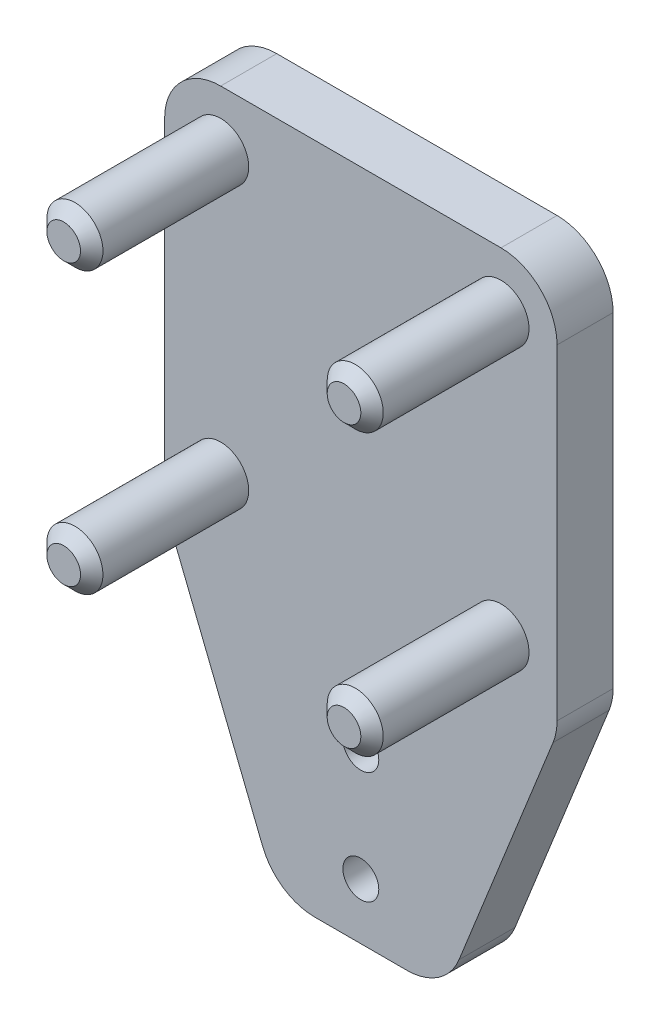
ISO-10303-21;
HEADER;
FILE_DESCRIPTION(('STEP AP214'),'2;1');
FILE_NAME('part.step','',(''),(''),'','','');
FILE_SCHEMA(('AUTOMOTIVE_DESIGN { 1 0 10303 214 1 1 1 1 }'));
ENDSEC;
DATA;
#1=APPLICATION_CONTEXT('core data for automotive mechanical design processes');
#2=APPLICATION_PROTOCOL_DEFINITION('international standard','automotive_design',2000,#1);
#3=PRODUCT_CONTEXT('',#1,'mechanical');
#4=PRODUCT('Part','Part','',(#3));
#5=PRODUCT_RELATED_PRODUCT_CATEGORY('part','',(#4));
#6=PRODUCT_DEFINITION_FORMATION('','',#4);
#7=PRODUCT_DEFINITION_CONTEXT('part definition',#1,'design');
#8=PRODUCT_DEFINITION('design','',#6,#7);
#9=PRODUCT_DEFINITION_SHAPE('','',#8);
#10=(LENGTH_UNIT() NAMED_UNIT(*) SI_UNIT(.MILLI.,.METRE.));
#11=(NAMED_UNIT(*) PLANE_ANGLE_UNIT() SI_UNIT($,.RADIAN.));
#12=(NAMED_UNIT(*) SI_UNIT($,.STERADIAN.) SOLID_ANGLE_UNIT());
#13=UNCERTAINTY_MEASURE_WITH_UNIT(LENGTH_MEASURE(1.E-05),#10,'distance_accuracy_value','');
#14=(GEOMETRIC_REPRESENTATION_CONTEXT(3) GLOBAL_UNCERTAINTY_ASSIGNED_CONTEXT((#13)) GLOBAL_UNIT_ASSIGNED_CONTEXT((#10,
#11,#12)) REPRESENTATION_CONTEXT('',''));
#15=CARTESIAN_POINT('',(0.,0.,0.));
#16=DIRECTION('',(0.,0.,1.));
#17=DIRECTION('',(1.,0.,0.));
#18=AXIS2_PLACEMENT_3D('',#15,#16,#17);
#19=CARTESIAN_POINT('',(0.,0.,5.));
#20=DIRECTION('',(0.,1.,0.));
#21=DIRECTION('',(0.,0.,1.));
#22=AXIS2_PLACEMENT_3D('',#19,#20,#21);
#23=PLANE('',#22);
#24=DIRECTION('',(1.,0.,0.));
#25=VECTOR('',#24,1.);
#26=CARTESIAN_POINT('',(0.,0.,0.));
#27=LINE('',#26,#25);
#28=CARTESIAN_POINT('',(5.,0.,0.));
#29=VERTEX_POINT('',#28);
#30=CARTESIAN_POINT('',(30.,0.,0.));
#31=VERTEX_POINT('',#30);
#32=EDGE_CURVE('E167',#29,#31,#27,.T.);
#33=ORIENTED_EDGE('',*,*,#32,.F.);
#34=DIRECTION('',(0.,0.,-1.));
#35=VECTOR('',#34,1.);
#36=CARTESIAN_POINT('',(5.,0.,5.));
#37=LINE('',#36,#35);
#38=CARTESIAN_POINT('',(5.,0.,5.));
#39=VERTEX_POINT('',#38);
#40=EDGE_CURVE('E134',#29,#39,#37,.F.);
#41=ORIENTED_EDGE('',*,*,#40,.T.);
#42=DIRECTION('',(1.,0.,0.));
#43=VECTOR('',#42,1.);
#44=CARTESIAN_POINT('',(0.,0.,5.));
#45=LINE('',#44,#43);
#46=CARTESIAN_POINT('',(30.,0.,5.));
#47=VERTEX_POINT('',#46);
#48=EDGE_CURVE('E159',#39,#47,#45,.T.);
#49=ORIENTED_EDGE('',*,*,#48,.T.);
#50=DIRECTION('',(0.,0.,-1.));
#51=VECTOR('',#50,1.);
#52=CARTESIAN_POINT('',(30.,0.,5.));
#53=LINE('',#52,#51);
#54=EDGE_CURVE('E140',#47,#31,#53,.T.);
#55=ORIENTED_EDGE('',*,*,#54,.T.);
#56=EDGE_LOOP('',(#33,#41,#49,#55));
#57=FACE_BOUND('',#56,.T.);
#58=ADVANCED_FACE('F39',(#57),#23,.T.);
#59=CARTESIAN_POINT('',(0.,0.,5.));
#60=DIRECTION('',(1.,0.,0.));
#61=DIRECTION('',(0.,0.,-1.));
#62=AXIS2_PLACEMENT_3D('',#59,#60,#61);
#63=PLANE('',#62);
#64=DIRECTION('',(0.,-1.,0.));
#65=VECTOR('',#64,1.);
#66=CARTESIAN_POINT('',(0.,0.,0.));
#67=LINE('',#66,#65);
#68=CARTESIAN_POINT('',(0.,-5.,0.));
#69=VERTEX_POINT('',#68);
#70=CARTESIAN_POINT('',(0.,-34.0370879821637,0.));
#71=VERTEX_POINT('',#70);
#72=EDGE_CURVE('E147',#69,#71,#67,.T.);
#73=ORIENTED_EDGE('',*,*,#72,.T.);
#74=DIRECTION('',(0.,0.,-1.));
#75=VECTOR('',#74,1.);
#76=CARTESIAN_POINT('',(0.,-34.0370879821637,5.));
#77=LINE('',#76,#75);
#78=CARTESIAN_POINT('',(0.,-34.0370879821637,5.));
#79=VERTEX_POINT('',#78);
#80=EDGE_CURVE('E284',#71,#79,#77,.F.);
#81=ORIENTED_EDGE('',*,*,#80,.T.);
#82=DIRECTION('',(0.,-1.,0.));
#83=VECTOR('',#82,1.);
#84=CARTESIAN_POINT('',(0.,0.,5.));
#85=LINE('',#84,#83);
#86=CARTESIAN_POINT('',(0.,-5.,5.));
#87=VERTEX_POINT('',#86);
#88=EDGE_CURVE('E150',#87,#79,#85,.T.);
#89=ORIENTED_EDGE('',*,*,#88,.F.);
#90=DIRECTION('',(0.,0.,-1.));
#91=VECTOR('',#90,1.);
#92=CARTESIAN_POINT('',(0.,-5.,0.));
#93=LINE('',#92,#91);
#94=EDGE_CURVE('E133',#87,#69,#93,.T.);
#95=ORIENTED_EDGE('',*,*,#94,.T.);
#96=EDGE_LOOP('',(#73,#81,#89,#95));
#97=FACE_BOUND('',#96,.T.);
#98=ADVANCED_FACE('F146',(#97),#63,.F.);
#99=CARTESIAN_POINT('',(35.,0.,5.));
#100=DIRECTION('',(1.,0.,0.));
#101=DIRECTION('',(0.,1.,0.));
#102=AXIS2_PLACEMENT_3D('',#99,#100,#101);
#103=PLANE('',#102);
#104=DIRECTION('',(0.,-1.,0.));
#105=VECTOR('',#104,1.);
#106=CARTESIAN_POINT('',(35.,0.,5.));
#107=LINE('',#106,#105);
#108=CARTESIAN_POINT('',(35.,-5.,5.));
#109=VERTEX_POINT('',#108);
#110=CARTESIAN_POINT('',(35.,-34.0370879821638,5.));
#111=VERTEX_POINT('',#110);
#112=EDGE_CURVE('E165',#109,#111,#107,.T.);
#113=ORIENTED_EDGE('',*,*,#112,.T.);
#114=DIRECTION('',(0.,0.,-1.));
#115=VECTOR('',#114,1.);
#116=CARTESIAN_POINT('',(35.,-34.0370879821638,0.));
#117=LINE('',#116,#115);
#118=CARTESIAN_POINT('',(35.,-34.0370879821638,0.));
#119=VERTEX_POINT('',#118);
#120=EDGE_CURVE('E234',#111,#119,#117,.T.);
#121=ORIENTED_EDGE('',*,*,#120,.T.);
#122=DIRECTION('',(0.,-1.,0.));
#123=VECTOR('',#122,1.);
#124=CARTESIAN_POINT('',(35.,0.,0.));
#125=LINE('',#124,#123);
#126=CARTESIAN_POINT('',(35.,-5.,0.));
#127=VERTEX_POINT('',#126);
#128=EDGE_CURVE('E160',#127,#119,#125,.T.);
#129=ORIENTED_EDGE('',*,*,#128,.F.);
#130=DIRECTION('',(0.,0.,-1.));
#131=VECTOR('',#130,1.);
#132=CARTESIAN_POINT('',(35.,-5.,5.));
#133=LINE('',#132,#131);
#134=EDGE_CURVE('E199',#127,#109,#133,.F.);
#135=ORIENTED_EDGE('',*,*,#134,.T.);
#136=EDGE_LOOP('',(#113,#121,#129,#135));
#137=FACE_BOUND('',#136,.T.);
#138=ADVANCED_FACE('F336',(#137),#103,.T.);
#139=CARTESIAN_POINT('',(0.,0.,5.));
#140=DIRECTION('',(0.,0.,-1.));
#141=DIRECTION('',(-1.,0.,0.));
#142=AXIS2_PLACEMENT_3D('',#139,#140,#141);
#143=PLANE('',#142);
#144=CARTESIAN_POINT('',(17.5,-45.,5.));
#145=DIRECTION('',(0.,0.,1.));
#146=DIRECTION('',(1.,0.,0.));
#147=AXIS2_PLACEMENT_3D('',#144,#145,#146);
#148=CIRCLE('',#147,1.6);
#149=CARTESIAN_POINT('',(19.1,-45.,5.));
#150=VERTEX_POINT('',#149);
#151=EDGE_CURVE('E240',#150,#150,#148,.T.);
#152=ORIENTED_EDGE('',*,*,#151,.F.);
#153=EDGE_LOOP('',(#152));
#154=FACE_BOUND('',#153,.T.);
#155=CARTESIAN_POINT('',(17.5,-55.,5.));
#156=DIRECTION('',(0.,0.,1.));
#157=DIRECTION('',(1.,0.,0.));
#158=AXIS2_PLACEMENT_3D('',#155,#156,#157);
#159=CIRCLE('',#158,1.60000000000001);
#160=CARTESIAN_POINT('',(19.1,-55.,5.));
#161=VERTEX_POINT('',#160);
#162=EDGE_CURVE('E323',#161,#161,#159,.T.);
#163=ORIENTED_EDGE('',*,*,#162,.F.);
#164=EDGE_LOOP('',(#163));
#165=FACE_BOUND('',#164,.T.);
#166=CARTESIAN_POINT('',(30.,-30.,5.));
#167=DIRECTION('',(0.,0.,-1.));
#168=DIRECTION('',(-1.,0.,0.));
#169=AXIS2_PLACEMENT_3D('',#166,#167,#168);
#170=CIRCLE('',#169,2.5);
#171=CARTESIAN_POINT('',(27.5,-30.,5.));
#172=VERTEX_POINT('',#171);
#173=EDGE_CURVE('E179',#172,#172,#170,.F.);
#174=ORIENTED_EDGE('',*,*,#173,.F.);
#175=EDGE_LOOP('',(#174));
#176=FACE_BOUND('',#175,.T.);
#177=CARTESIAN_POINT('',(5.,-30.,5.));
#178=DIRECTION('',(0.,0.,-1.));
#179=DIRECTION('',(-1.,0.,0.));
#180=AXIS2_PLACEMENT_3D('',#177,#178,#179);
#181=CIRCLE('',#180,2.5);
#182=CARTESIAN_POINT('',(2.49999999999999,-30.,5.));
#183=VERTEX_POINT('',#182);
#184=EDGE_CURVE('E152',#183,#183,#181,.F.);
#185=ORIENTED_EDGE('',*,*,#184,.F.);
#186=EDGE_LOOP('',(#185));
#187=FACE_BOUND('',#186,.T.);
#188=DIRECTION('',(-0.371390676354104,-0.928476690885259,0.));
#189=VECTOR('',#188,1.);
#190=CARTESIAN_POINT('',(25.,-60.,5.));
#191=LINE('',#190,#189);
#192=CARTESIAN_POINT('',(34.6423834544263,-35.8940413639343,5.));
#193=VERTEX_POINT('',#192);
#194=CARTESIAN_POINT('',(26.2572186472918,-56.8569533817705,5.));
#195=VERTEX_POINT('',#194);
#196=EDGE_CURVE('E302',#193,#195,#191,.T.);
#197=ORIENTED_EDGE('',*,*,#196,.F.);
#198=CARTESIAN_POINT('',(30.,-34.0370879821638,5.));
#199=DIRECTION('',(0.,0.,-1.));
#200=DIRECTION('',(-1.,0.,0.));
#201=AXIS2_PLACEMENT_3D('',#198,#199,#200);
#202=CIRCLE('',#201,5.);
#203=EDGE_CURVE('E274',#193,#111,#202,.F.);
#204=ORIENTED_EDGE('',*,*,#203,.T.);
#205=ORIENTED_EDGE('',*,*,#112,.F.);
#206=CARTESIAN_POINT('',(30.,-5.,5.));
#207=DIRECTION('',(0.,0.,-1.));
#208=DIRECTION('',(-1.,0.,0.));
#209=AXIS2_PLACEMENT_3D('',#206,#207,#208);
#210=CIRCLE('',#209,5.);
#211=EDGE_CURVE('E193',#109,#47,#210,.F.);
#212=ORIENTED_EDGE('',*,*,#211,.T.);
#213=ORIENTED_EDGE('',*,*,#48,.F.);
#214=CARTESIAN_POINT('',(5.,-5.,5.));
#215=DIRECTION('',(0.,0.,-1.));
#216=DIRECTION('',(-1.,0.,0.));
#217=AXIS2_PLACEMENT_3D('',#214,#215,#216);
#218=CIRCLE('',#217,5.);
#219=EDGE_CURVE('E196',#39,#87,#218,.F.);
#220=ORIENTED_EDGE('',*,*,#219,.T.);
#221=ORIENTED_EDGE('',*,*,#88,.T.);
#222=CARTESIAN_POINT('',(5.,-34.0370879821637,5.));
#223=DIRECTION('',(0.,0.,-1.));
#224=DIRECTION('',(-1.,0.,0.));
#225=AXIS2_PLACEMENT_3D('',#222,#223,#224);
#226=CIRCLE('',#225,5.);
#227=CARTESIAN_POINT('',(0.357616545573705,-35.8940413639343,5.));
#228=VERTEX_POINT('',#227);
#229=EDGE_CURVE('E271',#79,#228,#226,.F.);
#230=ORIENTED_EDGE('',*,*,#229,.T.);
#231=DIRECTION('',(-0.371390676354104,0.928476690885259,0.));
#232=VECTOR('',#231,1.);
#233=CARTESIAN_POINT('',(0.,-35.,5.));
#234=LINE('',#233,#232);
#235=CARTESIAN_POINT('',(8.74278135270821,-56.8569533817705,5.));
#236=VERTEX_POINT('',#235);
#237=EDGE_CURVE('E312',#236,#228,#234,.T.);
#238=ORIENTED_EDGE('',*,*,#237,.F.);
#239=CARTESIAN_POINT('',(13.3851648071345,-55.,5.));
#240=DIRECTION('',(0.,0.,-1.));
#241=DIRECTION('',(-1.,0.,0.));
#242=AXIS2_PLACEMENT_3D('',#239,#240,#241);
#243=CIRCLE('',#242,5.);
#244=CARTESIAN_POINT('',(13.3851648071345,-60.,5.));
#245=VERTEX_POINT('',#244);
#246=EDGE_CURVE('E60',#236,#245,#243,.F.);
#247=ORIENTED_EDGE('',*,*,#246,.T.);
#248=DIRECTION('',(1.,0.,0.));
#249=VECTOR('',#248,1.);
#250=CARTESIAN_POINT('',(25.,-60.,5.));
#251=LINE('',#250,#249);
#252=CARTESIAN_POINT('',(21.6148351928655,-60.,5.));
#253=VERTEX_POINT('',#252);
#254=EDGE_CURVE('E292',#245,#253,#251,.T.);
#255=ORIENTED_EDGE('',*,*,#254,.T.);
#256=CARTESIAN_POINT('',(21.6148351928655,-55.,5.));
#257=DIRECTION('',(0.,0.,-1.));
#258=DIRECTION('',(-1.,0.,0.));
#259=AXIS2_PLACEMENT_3D('',#256,#257,#258);
#260=CIRCLE('',#259,5.);
#261=EDGE_CURVE('E268',#253,#195,#260,.F.);
#262=ORIENTED_EDGE('',*,*,#261,.T.);
#263=EDGE_LOOP('',(#197,#204,#205,#212,#213,#220,#221,#230,#238,#247,#255,#262));
#264=FACE_BOUND('',#263,.T.);
#265=CARTESIAN_POINT('',(5.,-5.,5.));
#266=DIRECTION('',(0.,0.,-1.));
#267=DIRECTION('',(-1.,0.,0.));
#268=AXIS2_PLACEMENT_3D('',#265,#266,#267);
#269=CIRCLE('',#268,2.5);
#270=CARTESIAN_POINT('',(2.5,-5.,5.));
#271=VERTEX_POINT('',#270);
#272=EDGE_CURVE('E171',#271,#271,#269,.F.);
#273=ORIENTED_EDGE('',*,*,#272,.F.);
#274=EDGE_LOOP('',(#273));
#275=FACE_BOUND('',#274,.T.);
#276=CARTESIAN_POINT('',(30.,-5.,5.));
#277=DIRECTION('',(0.,0.,-1.));
#278=DIRECTION('',(-1.,0.,0.));
#279=AXIS2_PLACEMENT_3D('',#276,#277,#278);
#280=CIRCLE('',#279,2.5);
#281=CARTESIAN_POINT('',(27.5,-5.,5.));
#282=VERTEX_POINT('',#281);
#283=EDGE_CURVE('E175',#282,#282,#280,.F.);
#284=ORIENTED_EDGE('',*,*,#283,.F.);
#285=EDGE_LOOP('',(#284));
#286=FACE_BOUND('',#285,.T.);
#287=ADVANCED_FACE('F333',(#154,#165,#176,#187,#264,#275,#286),#143,.F.);
#288=CARTESIAN_POINT('',(0.,0.,0.));
#289=DIRECTION('',(0.,0.,-1.));
#290=DIRECTION('',(-1.,0.,0.));
#291=AXIS2_PLACEMENT_3D('',#288,#289,#290);
#292=PLANE('',#291);
#293=CARTESIAN_POINT('',(17.5,-45.,0.));
#294=DIRECTION('',(0.,0.,-1.));
#295=DIRECTION('',(-1.,0.,0.));
#296=AXIS2_PLACEMENT_3D('',#293,#294,#295);
#297=CIRCLE('',#296,1.6);
#298=CARTESIAN_POINT('',(15.9,-45.,0.));
#299=VERTEX_POINT('',#298);
#300=EDGE_CURVE('E239',#299,#299,#297,.T.);
#301=ORIENTED_EDGE('',*,*,#300,.F.);
#302=EDGE_LOOP('',(#301));
#303=FACE_BOUND('',#302,.T.);
#304=CARTESIAN_POINT('',(17.5,-55.,0.));
#305=DIRECTION('',(0.,0.,-1.));
#306=DIRECTION('',(-1.,0.,0.));
#307=AXIS2_PLACEMENT_3D('',#304,#305,#306);
#308=CIRCLE('',#307,1.60000000000001);
#309=CARTESIAN_POINT('',(15.9,-55.,0.));
#310=VERTEX_POINT('',#309);
#311=EDGE_CURVE('E235',#310,#310,#308,.T.);
#312=ORIENTED_EDGE('',*,*,#311,.F.);
#313=EDGE_LOOP('',(#312));
#314=FACE_BOUND('',#313,.T.);
#315=ORIENTED_EDGE('',*,*,#128,.T.);
#316=CARTESIAN_POINT('',(30.,-34.0370879821638,0.));
#317=DIRECTION('',(0.,0.,-1.));
#318=DIRECTION('',(-1.,0.,0.));
#319=AXIS2_PLACEMENT_3D('',#316,#317,#318);
#320=CIRCLE('',#319,5.);
#321=CARTESIAN_POINT('',(34.6423834544263,-35.8940413639343,0.));
#322=VERTEX_POINT('',#321);
#323=EDGE_CURVE('E256',#119,#322,#320,.T.);
#324=ORIENTED_EDGE('',*,*,#323,.T.);
#325=DIRECTION('',(0.371390676354104,0.928476690885259,0.));
#326=VECTOR('',#325,1.);
#327=CARTESIAN_POINT('',(25.,-60.,0.));
#328=LINE('',#327,#326);
#329=CARTESIAN_POINT('',(26.2572186472918,-56.8569533817705,0.));
#330=VERTEX_POINT('',#329);
#331=EDGE_CURVE('E297',#330,#322,#328,.T.);
#332=ORIENTED_EDGE('',*,*,#331,.F.);
#333=CARTESIAN_POINT('',(21.6148351928655,-55.,0.));
#334=DIRECTION('',(0.,0.,-1.));
#335=DIRECTION('',(-1.,0.,0.));
#336=AXIS2_PLACEMENT_3D('',#333,#334,#335);
#337=CIRCLE('',#336,5.);
#338=CARTESIAN_POINT('',(21.6148351928655,-60.,0.));
#339=VERTEX_POINT('',#338);
#340=EDGE_CURVE('E251',#330,#339,#337,.T.);
#341=ORIENTED_EDGE('',*,*,#340,.T.);
#342=DIRECTION('',(-1.,0.,0.));
#343=VECTOR('',#342,1.);
#344=CARTESIAN_POINT('',(25.,-60.,0.));
#345=LINE('',#344,#343);
#346=CARTESIAN_POINT('',(13.3851648071345,-60.,0.));
#347=VERTEX_POINT('',#346);
#348=EDGE_CURVE('E291',#339,#347,#345,.T.);
#349=ORIENTED_EDGE('',*,*,#348,.T.);
#350=CARTESIAN_POINT('',(13.3851648071345,-55.,0.));
#351=DIRECTION('',(0.,0.,-1.));
#352=DIRECTION('',(-1.,0.,0.));
#353=AXIS2_PLACEMENT_3D('',#350,#351,#352);
#354=CIRCLE('',#353,5.);
#355=CARTESIAN_POINT('',(8.7427813527082,-56.8569533817705,0.));
#356=VERTEX_POINT('',#355);
#357=EDGE_CURVE('E248',#347,#356,#354,.T.);
#358=ORIENTED_EDGE('',*,*,#357,.T.);
#359=DIRECTION('',(0.371390676354104,-0.928476690885259,0.));
#360=VECTOR('',#359,1.);
#361=CARTESIAN_POINT('',(0.,-35.,0.));
#362=LINE('',#361,#360);
#363=CARTESIAN_POINT('',(0.357616545573705,-35.8940413639343,0.));
#364=VERTEX_POINT('',#363);
#365=EDGE_CURVE('E244',#364,#356,#362,.T.);
#366=ORIENTED_EDGE('',*,*,#365,.F.);
#367=CARTESIAN_POINT('',(5.,-34.0370879821637,0.));
#368=DIRECTION('',(0.,0.,-1.));
#369=DIRECTION('',(-1.,0.,0.));
#370=AXIS2_PLACEMENT_3D('',#367,#368,#369);
#371=CIRCLE('',#370,5.);
#372=EDGE_CURVE('E157',#364,#71,#371,.T.);
#373=ORIENTED_EDGE('',*,*,#372,.T.);
#374=ORIENTED_EDGE('',*,*,#72,.F.);
#375=CARTESIAN_POINT('',(5.,-5.,0.));
#376=DIRECTION('',(0.,0.,-1.));
#377=DIRECTION('',(-1.,0.,0.));
#378=AXIS2_PLACEMENT_3D('',#375,#376,#377);
#379=CIRCLE('',#378,5.);
#380=EDGE_CURVE('E129',#69,#29,#379,.T.);
#381=ORIENTED_EDGE('',*,*,#380,.T.);
#382=ORIENTED_EDGE('',*,*,#32,.T.);
#383=CARTESIAN_POINT('',(30.,-5.,0.));
#384=DIRECTION('',(0.,0.,-1.));
#385=DIRECTION('',(-1.,0.,0.));
#386=AXIS2_PLACEMENT_3D('',#383,#384,#385);
#387=CIRCLE('',#386,5.);
#388=EDGE_CURVE('E141',#31,#127,#387,.T.);
#389=ORIENTED_EDGE('',*,*,#388,.T.);
#390=EDGE_LOOP('',(#315,#324,#332,#341,#349,#358,#366,#373,#374,#381,#382,#389));
#391=FACE_BOUND('',#390,.T.);
#392=ADVANCED_FACE('F155',(#303,#314,#391),#292,.T.);
#393=CARTESIAN_POINT('',(5.,-5.,19.));
#394=DIRECTION('',(0.,0.,-1.));
#395=DIRECTION('',(-1.,0.,0.));
#396=AXIS2_PLACEMENT_3D('',#393,#394,#395);
#397=CYLINDRICAL_SURFACE('',#396,2.5);
#398=CARTESIAN_POINT('',(5.,-5.,18.));
#399=DIRECTION('',(0.,0.,1.));
#400=DIRECTION('',(1.,0.,0.));
#401=AXIS2_PLACEMENT_3D('',#398,#399,#400);
#402=CIRCLE('',#401,2.5);
#403=CARTESIAN_POINT('',(7.5,-5.,18.));
#404=VERTEX_POINT('',#403);
#405=EDGE_CURVE('E230',#404,#404,#402,.F.);
#406=ORIENTED_EDGE('',*,*,#405,.T.);
#407=EDGE_LOOP('',(#406));
#408=FACE_BOUND('',#407,.T.);
#409=ORIENTED_EDGE('',*,*,#272,.T.);
#410=EDGE_LOOP('',(#409));
#411=FACE_BOUND('',#410,.T.);
#412=ADVANCED_FACE('F363',(#408,#411),#397,.T.);
#413=CARTESIAN_POINT('',(5.,-5.,19.));
#414=DIRECTION('',(0.,0.,1.));
#415=DIRECTION('',(1.,0.,0.));
#416=AXIS2_PLACEMENT_3D('',#413,#414,#415);
#417=PLANE('',#416);
#418=CARTESIAN_POINT('',(5.,-5.,19.));
#419=DIRECTION('',(0.,0.,1.));
#420=DIRECTION('',(1.,0.,0.));
#421=AXIS2_PLACEMENT_3D('',#418,#419,#420);
#422=CIRCLE('',#421,1.49999999999999);
#423=CARTESIAN_POINT('',(6.49999999999999,-5.,19.));
#424=VERTEX_POINT('',#423);
#425=EDGE_CURVE('E226',#424,#424,#422,.T.);
#426=ORIENTED_EDGE('',*,*,#425,.T.);
#427=EDGE_LOOP('',(#426));
#428=FACE_BOUND('',#427,.T.);
#429=ADVANCED_FACE('F353',(#428),#417,.T.);
#430=CARTESIAN_POINT('',(30.,-5.,19.));
#431=DIRECTION('',(0.,0.,-1.));
#432=DIRECTION('',(-1.,0.,0.));
#433=AXIS2_PLACEMENT_3D('',#430,#431,#432);
#434=CYLINDRICAL_SURFACE('',#433,2.5);
#435=CARTESIAN_POINT('',(30.,-5.,18.));
#436=DIRECTION('',(0.,0.,-1.));
#437=DIRECTION('',(-1.,0.,0.));
#438=AXIS2_PLACEMENT_3D('',#435,#436,#437);
#439=CIRCLE('',#438,2.5);
#440=CARTESIAN_POINT('',(27.5,-5.,18.));
#441=VERTEX_POINT('',#440);
#442=EDGE_CURVE('E214',#441,#441,#439,.T.);
#443=ORIENTED_EDGE('',*,*,#442,.T.);
#444=EDGE_LOOP('',(#443));
#445=FACE_BOUND('',#444,.T.);
#446=ORIENTED_EDGE('',*,*,#283,.T.);
#447=EDGE_LOOP('',(#446));
#448=FACE_BOUND('',#447,.T.);
#449=ADVANCED_FACE('F350',(#445,#448),#434,.T.);
#450=CARTESIAN_POINT('',(30.,-5.,19.));
#451=DIRECTION('',(0.,0.,-1.));
#452=DIRECTION('',(-1.,0.,0.));
#453=AXIS2_PLACEMENT_3D('',#450,#451,#452);
#454=PLANE('',#453);
#455=CARTESIAN_POINT('',(30.,-5.,19.));
#456=DIRECTION('',(0.,0.,-1.));
#457=DIRECTION('',(-1.,0.,0.));
#458=AXIS2_PLACEMENT_3D('',#455,#456,#457);
#459=CIRCLE('',#458,1.5);
#460=CARTESIAN_POINT('',(28.5,-5.,19.));
#461=VERTEX_POINT('',#460);
#462=EDGE_CURVE('E210',#461,#461,#459,.F.);
#463=ORIENTED_EDGE('',*,*,#462,.T.);
#464=EDGE_LOOP('',(#463));
#465=FACE_BOUND('',#464,.T.);
#466=ADVANCED_FACE('F352',(#465),#454,.F.);
#467=CARTESIAN_POINT('',(30.,-30.,19.));
#468=DIRECTION('',(0.,0.,-1.));
#469=DIRECTION('',(-1.,0.,0.));
#470=AXIS2_PLACEMENT_3D('',#467,#468,#469);
#471=CYLINDRICAL_SURFACE('',#470,2.5);
#472=CARTESIAN_POINT('',(30.,-30.,18.));
#473=DIRECTION('',(0.,0.,1.));
#474=DIRECTION('',(1.,0.,0.));
#475=AXIS2_PLACEMENT_3D('',#472,#473,#474);
#476=CIRCLE('',#475,2.5);
#477=CARTESIAN_POINT('',(32.5,-30.,18.));
#478=VERTEX_POINT('',#477);
#479=EDGE_CURVE('E206',#478,#478,#476,.F.);
#480=ORIENTED_EDGE('',*,*,#479,.T.);
#481=EDGE_LOOP('',(#480));
#482=FACE_BOUND('',#481,.T.);
#483=ORIENTED_EDGE('',*,*,#173,.T.);
#484=EDGE_LOOP('',(#483));
#485=FACE_BOUND('',#484,.T.);
#486=ADVANCED_FACE('F360',(#482,#485),#471,.T.);
#487=CARTESIAN_POINT('',(30.,-30.,19.));
#488=DIRECTION('',(0.,0.,1.));
#489=DIRECTION('',(1.,0.,0.));
#490=AXIS2_PLACEMENT_3D('',#487,#488,#489);
#491=PLANE('',#490);
#492=CARTESIAN_POINT('',(30.,-30.,19.));
#493=DIRECTION('',(0.,0.,1.));
#494=DIRECTION('',(1.,0.,0.));
#495=AXIS2_PLACEMENT_3D('',#492,#493,#494);
#496=CIRCLE('',#495,1.49999999999999);
#497=CARTESIAN_POINT('',(31.5,-30.,19.));
#498=VERTEX_POINT('',#497);
#499=EDGE_CURVE('E202',#498,#498,#496,.T.);
#500=ORIENTED_EDGE('',*,*,#499,.T.);
#501=EDGE_LOOP('',(#500));
#502=FACE_BOUND('',#501,.T.);
#503=ADVANCED_FACE('F445',(#502),#491,.T.);
#504=CARTESIAN_POINT('',(5.,-30.,19.));
#505=DIRECTION('',(0.,0.,-1.));
#506=DIRECTION('',(-1.,0.,0.));
#507=AXIS2_PLACEMENT_3D('',#504,#505,#506);
#508=CYLINDRICAL_SURFACE('',#507,2.5);
#509=CARTESIAN_POINT('',(5.,-30.,18.));
#510=DIRECTION('',(0.,0.,-1.));
#511=DIRECTION('',(-1.,0.,0.));
#512=AXIS2_PLACEMENT_3D('',#509,#510,#511);
#513=CIRCLE('',#512,2.5);
#514=CARTESIAN_POINT('',(2.49999999999999,-30.,18.));
#515=VERTEX_POINT('',#514);
#516=EDGE_CURVE('E222',#515,#515,#513,.T.);
#517=ORIENTED_EDGE('',*,*,#516,.T.);
#518=EDGE_LOOP('',(#517));
#519=FACE_BOUND('',#518,.T.);
#520=ORIENTED_EDGE('',*,*,#184,.T.);
#521=EDGE_LOOP('',(#520));
#522=FACE_BOUND('',#521,.T.);
#523=ADVANCED_FACE('F441',(#519,#522),#508,.T.);
#524=CARTESIAN_POINT('',(5.,-30.,19.));
#525=DIRECTION('',(0.,0.,-1.));
#526=DIRECTION('',(-1.,0.,0.));
#527=AXIS2_PLACEMENT_3D('',#524,#525,#526);
#528=PLANE('',#527);
#529=CARTESIAN_POINT('',(5.,-30.,19.));
#530=DIRECTION('',(0.,0.,-1.));
#531=DIRECTION('',(-1.,0.,0.));
#532=AXIS2_PLACEMENT_3D('',#529,#530,#531);
#533=CIRCLE('',#532,1.49999999999999);
#534=CARTESIAN_POINT('',(3.50000000000001,-30.,19.));
#535=VERTEX_POINT('',#534);
#536=EDGE_CURVE('E218',#535,#535,#533,.F.);
#537=ORIENTED_EDGE('',*,*,#536,.T.);
#538=EDGE_LOOP('',(#537));
#539=FACE_BOUND('',#538,.T.);
#540=ADVANCED_FACE('F378',(#539),#528,.F.);
#541=CARTESIAN_POINT('',(5.,-5.,5.));
#542=DIRECTION('',(0.,0.,1.));
#543=DIRECTION('',(1.,0.,0.));
#544=AXIS2_PLACEMENT_3D('',#541,#542,#543);
#545=CYLINDRICAL_SURFACE('',#544,5.);
#546=ORIENTED_EDGE('',*,*,#219,.F.);
#547=ORIENTED_EDGE('',*,*,#40,.F.);
#548=ORIENTED_EDGE('',*,*,#380,.F.);
#549=ORIENTED_EDGE('',*,*,#94,.F.);
#550=EDGE_LOOP('',(#546,#547,#548,#549));
#551=FACE_BOUND('',#550,.T.);
#552=ADVANCED_FACE('F132',(#551),#545,.T.);
#553=CARTESIAN_POINT('',(30.,-5.,5.));
#554=DIRECTION('',(0.,0.,-1.));
#555=DIRECTION('',(-1.,0.,0.));
#556=AXIS2_PLACEMENT_3D('',#553,#554,#555);
#557=CYLINDRICAL_SURFACE('',#556,5.);
#558=ORIENTED_EDGE('',*,*,#211,.F.);
#559=ORIENTED_EDGE('',*,*,#134,.F.);
#560=ORIENTED_EDGE('',*,*,#388,.F.);
#561=ORIENTED_EDGE('',*,*,#54,.F.);
#562=EDGE_LOOP('',(#558,#559,#560,#561));
#563=FACE_BOUND('',#562,.T.);
#564=ADVANCED_FACE('F377',(#563),#557,.T.);
#565=CARTESIAN_POINT('',(30.,-30.,19.));
#566=DIRECTION('',(0.,0.,-1.));
#567=DIRECTION('',(-1.,0.,0.));
#568=AXIS2_PLACEMENT_3D('',#565,#566,#567);
#569=CONICAL_SURFACE('',#568,1.49999999999999,0.785398163397447);
#570=ORIENTED_EDGE('',*,*,#479,.F.);
#571=EDGE_LOOP('',(#570));
#572=FACE_BOUND('',#571,.T.);
#573=ORIENTED_EDGE('',*,*,#499,.F.);
#574=EDGE_LOOP('',(#573));
#575=FACE_BOUND('',#574,.T.);
#576=ADVANCED_FACE('F381',(#572,#575),#569,.T.);
#577=CARTESIAN_POINT('',(30.,-5.,19.));
#578=DIRECTION('',(0.,0.,-1.));
#579=DIRECTION('',(-1.,0.,0.));
#580=AXIS2_PLACEMENT_3D('',#577,#578,#579);
#581=CONICAL_SURFACE('',#580,1.5,0.785398163397438);
#582=ORIENTED_EDGE('',*,*,#442,.F.);
#583=EDGE_LOOP('',(#582));
#584=FACE_BOUND('',#583,.T.);
#585=ORIENTED_EDGE('',*,*,#462,.F.);
#586=EDGE_LOOP('',(#585));
#587=FACE_BOUND('',#586,.T.);
#588=ADVANCED_FACE('F385',(#584,#587),#581,.T.);
#589=CARTESIAN_POINT('',(5.,-30.,19.));
#590=DIRECTION('',(0.,0.,-1.));
#591=DIRECTION('',(-1.,0.,0.));
#592=AXIS2_PLACEMENT_3D('',#589,#590,#591);
#593=CONICAL_SURFACE('',#592,1.49999999999999,0.785398163397449);
#594=ORIENTED_EDGE('',*,*,#516,.F.);
#595=EDGE_LOOP('',(#594));
#596=FACE_BOUND('',#595,.T.);
#597=ORIENTED_EDGE('',*,*,#536,.F.);
#598=EDGE_LOOP('',(#597));
#599=FACE_BOUND('',#598,.T.);
#600=ADVANCED_FACE('F389',(#596,#599),#593,.T.);
#601=CARTESIAN_POINT('',(5.,-5.,19.));
#602=DIRECTION('',(0.,0.,-1.));
#603=DIRECTION('',(-1.,0.,0.));
#604=AXIS2_PLACEMENT_3D('',#601,#602,#603);
#605=CONICAL_SURFACE('',#604,1.49999999999999,0.785398163397448);
#606=ORIENTED_EDGE('',*,*,#405,.F.);
#607=EDGE_LOOP('',(#606));
#608=FACE_BOUND('',#607,.T.);
#609=ORIENTED_EDGE('',*,*,#425,.F.);
#610=EDGE_LOOP('',(#609));
#611=FACE_BOUND('',#610,.T.);
#612=ADVANCED_FACE('F393',(#608,#611),#605,.T.);
#613=CARTESIAN_POINT('',(25.,-60.,51.0977222864644));
#614=DIRECTION('',(-0.928476690885259,0.371390676354104,0.));
#615=DIRECTION('',(-0.371390676354104,-0.928476690885259,0.));
#616=AXIS2_PLACEMENT_3D('',#613,#614,#615);
#617=PLANE('',#616);
#618=ORIENTED_EDGE('',*,*,#331,.T.);
#619=DIRECTION('',(0.,0.,-1.));
#620=VECTOR('',#619,1.);
#621=CARTESIAN_POINT('',(34.6423834544263,-35.8940413639343,5.));
#622=LINE('',#621,#620);
#623=EDGE_CURVE('E263',#322,#193,#622,.F.);
#624=ORIENTED_EDGE('',*,*,#623,.T.);
#625=ORIENTED_EDGE('',*,*,#196,.T.);
#626=DIRECTION('',(0.,0.,-1.));
#627=VECTOR('',#626,1.);
#628=CARTESIAN_POINT('',(26.2572186472918,-56.8569533817705,0.));
#629=LINE('',#628,#627);
#630=EDGE_CURVE('E259',#195,#330,#629,.T.);
#631=ORIENTED_EDGE('',*,*,#630,.T.);
#632=EDGE_LOOP('',(#618,#624,#625,#631));
#633=FACE_BOUND('',#632,.T.);
#634=ADVANCED_FACE('F397',(#633),#617,.F.);
#635=CARTESIAN_POINT('',(25.,-60.,51.0977222864644));
#636=DIRECTION('',(0.,-1.,0.));
#637=DIRECTION('',(0.,0.,-1.));
#638=AXIS2_PLACEMENT_3D('',#635,#636,#637);
#639=PLANE('',#638);
#640=ORIENTED_EDGE('',*,*,#348,.F.);
#641=DIRECTION('',(0.,0.,-1.));
#642=VECTOR('',#641,1.);
#643=CARTESIAN_POINT('',(21.6148351928655,-60.,5.));
#644=LINE('',#643,#642);
#645=EDGE_CURVE('E11',#339,#253,#644,.F.);
#646=ORIENTED_EDGE('',*,*,#645,.T.);
#647=ORIENTED_EDGE('',*,*,#254,.F.);
#648=DIRECTION('',(0.,0.,-1.));
#649=VECTOR('',#648,1.);
#650=CARTESIAN_POINT('',(13.3851648071345,-60.,0.));
#651=LINE('',#650,#649);
#652=EDGE_CURVE('E48',#245,#347,#651,.T.);
#653=ORIENTED_EDGE('',*,*,#652,.T.);
#654=EDGE_LOOP('',(#640,#646,#647,#653));
#655=FACE_BOUND('',#654,.T.);
#656=ADVANCED_FACE('F290',(#655),#639,.T.);
#657=CARTESIAN_POINT('',(0.,-35.,51.0977222864644));
#658=DIRECTION('',(0.928476690885259,0.371390676354104,0.));
#659=DIRECTION('',(-0.371390676354104,0.928476690885259,0.));
#660=AXIS2_PLACEMENT_3D('',#657,#658,#659);
#661=PLANE('',#660);
#662=ORIENTED_EDGE('',*,*,#237,.T.);
#663=DIRECTION('',(0.,0.,-1.));
#664=VECTOR('',#663,1.);
#665=CARTESIAN_POINT('',(0.357616545573705,-35.8940413639343,51.0977222864644));
#666=LINE('',#665,#664);
#667=EDGE_CURVE('E280',#228,#364,#666,.T.);
#668=ORIENTED_EDGE('',*,*,#667,.T.);
#669=ORIENTED_EDGE('',*,*,#365,.T.);
#670=DIRECTION('',(0.,0.,-1.));
#671=VECTOR('',#670,1.);
#672=CARTESIAN_POINT('',(8.74278135270821,-56.8569533817705,5.));
#673=LINE('',#672,#671);
#674=EDGE_CURVE('E277',#356,#236,#673,.F.);
#675=ORIENTED_EDGE('',*,*,#674,.T.);
#676=EDGE_LOOP('',(#662,#668,#669,#675));
#677=FACE_BOUND('',#676,.T.);
#678=ADVANCED_FACE('F425',(#677),#661,.F.);
#679=CARTESIAN_POINT('',(17.5,-55.,-9.));
#680=DIRECTION('',(0.,0.,1.));
#681=DIRECTION('',(1.,0.,0.));
#682=AXIS2_PLACEMENT_3D('',#679,#680,#681);
#683=CYLINDRICAL_SURFACE('',#682,1.60000000000001);
#684=ORIENTED_EDGE('',*,*,#311,.T.);
#685=EDGE_LOOP('',(#684));
#686=FACE_BOUND('',#685,.T.);
#687=ORIENTED_EDGE('',*,*,#162,.T.);
#688=EDGE_LOOP('',(#687));
#689=FACE_BOUND('',#688,.T.);
#690=ADVANCED_FACE('F428',(#686,#689),#683,.F.);
#691=CARTESIAN_POINT('',(17.5,-45.,-9.));
#692=DIRECTION('',(0.,0.,1.));
#693=DIRECTION('',(1.,0.,0.));
#694=AXIS2_PLACEMENT_3D('',#691,#692,#693);
#695=CYLINDRICAL_SURFACE('',#694,1.6);
#696=ORIENTED_EDGE('',*,*,#300,.T.);
#697=EDGE_LOOP('',(#696));
#698=FACE_BOUND('',#697,.T.);
#699=ORIENTED_EDGE('',*,*,#151,.T.);
#700=EDGE_LOOP('',(#699));
#701=FACE_BOUND('',#700,.T.);
#702=ADVANCED_FACE('F331',(#698,#701),#695,.F.);
#703=CARTESIAN_POINT('',(30.,-34.0370879821638,5.));
#704=DIRECTION('',(0.,0.,1.));
#705=DIRECTION('',(1.,0.,0.));
#706=AXIS2_PLACEMENT_3D('',#703,#704,#705);
#707=CYLINDRICAL_SURFACE('',#706,5.);
#708=ORIENTED_EDGE('',*,*,#203,.F.);
#709=ORIENTED_EDGE('',*,*,#623,.F.);
#710=ORIENTED_EDGE('',*,*,#323,.F.);
#711=ORIENTED_EDGE('',*,*,#120,.F.);
#712=EDGE_LOOP('',(#708,#709,#710,#711));
#713=FACE_BOUND('',#712,.T.);
#714=ADVANCED_FACE('F399',(#713),#707,.T.);
#715=CARTESIAN_POINT('',(5.,-34.0370879821637,51.0977222864644));
#716=DIRECTION('',(0.,0.,-1.));
#717=DIRECTION('',(-1.,0.,0.));
#718=AXIS2_PLACEMENT_3D('',#715,#716,#717);
#719=CYLINDRICAL_SURFACE('',#718,5.);
#720=ORIENTED_EDGE('',*,*,#229,.F.);
#721=ORIENTED_EDGE('',*,*,#80,.F.);
#722=ORIENTED_EDGE('',*,*,#372,.F.);
#723=ORIENTED_EDGE('',*,*,#667,.F.);
#724=EDGE_LOOP('',(#720,#721,#722,#723));
#725=FACE_BOUND('',#724,.T.);
#726=ADVANCED_FACE('F402',(#725),#719,.T.);
#727=CARTESIAN_POINT('',(21.6148351928655,-55.,51.0977222864644));
#728=DIRECTION('',(0.,0.,1.));
#729=DIRECTION('',(1.,0.,0.));
#730=AXIS2_PLACEMENT_3D('',#727,#728,#729);
#731=CYLINDRICAL_SURFACE('',#730,5.);
#732=ORIENTED_EDGE('',*,*,#261,.F.);
#733=ORIENTED_EDGE('',*,*,#645,.F.);
#734=ORIENTED_EDGE('',*,*,#340,.F.);
#735=ORIENTED_EDGE('',*,*,#630,.F.);
#736=EDGE_LOOP('',(#732,#733,#734,#735));
#737=FACE_BOUND('',#736,.T.);
#738=ADVANCED_FACE('F405',(#737),#731,.T.);
#739=CARTESIAN_POINT('',(13.3851648071345,-55.,51.0977222864644));
#740=DIRECTION('',(0.,0.,1.));
#741=DIRECTION('',(1.,0.,0.));
#742=AXIS2_PLACEMENT_3D('',#739,#740,#741);
#743=CYLINDRICAL_SURFACE('',#742,5.);
#744=ORIENTED_EDGE('',*,*,#246,.F.);
#745=ORIENTED_EDGE('',*,*,#674,.F.);
#746=ORIENTED_EDGE('',*,*,#357,.F.);
#747=ORIENTED_EDGE('',*,*,#652,.F.);
#748=EDGE_LOOP('',(#744,#745,#746,#747));
#749=FACE_BOUND('',#748,.T.);
#750=ADVANCED_FACE('F41',(#749),#743,.T.);
#751=CLOSED_SHELL('',(#58,#98,#138,#287,#392,#412,#429,#449,#466,#486,#503,#523,#540,#552,#564,
#576,#588,#600,#612,#634,#656,#678,#690,#702,#714,#726,#738,#750));
#752=MANIFOLD_SOLID_BREP('B2',#751);
#753=ADVANCED_BREP_SHAPE_REPRESENTATION('',(#18,#752),#14);
#754=SHAPE_DEFINITION_REPRESENTATION(#9,#753);
ENDSEC;
END-ISO-10303-21;
